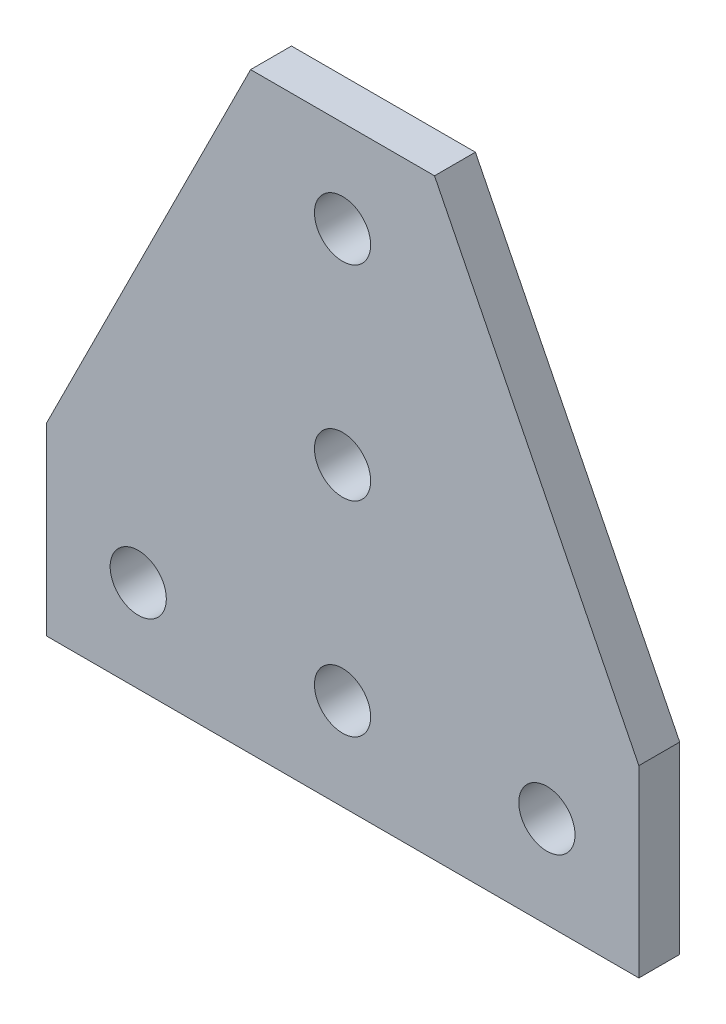
ISO-10303-21;
HEADER;
FILE_DESCRIPTION(('STEP AP214'),'2;1');
FILE_NAME('part.step','',(''),(''),'','','');
FILE_SCHEMA(('AUTOMOTIVE_DESIGN { 1 0 10303 214 1 1 1 1 }'));
ENDSEC;
DATA;
#1=APPLICATION_CONTEXT('core data for automotive mechanical design processes');
#2=APPLICATION_PROTOCOL_DEFINITION('international standard','automotive_design',2000,#1);
#3=PRODUCT_CONTEXT('',#1,'mechanical');
#4=PRODUCT('Part','Part','',(#3));
#5=PRODUCT_RELATED_PRODUCT_CATEGORY('part','',(#4));
#6=PRODUCT_DEFINITION_FORMATION('','',#4);
#7=PRODUCT_DEFINITION_CONTEXT('part definition',#1,'design');
#8=PRODUCT_DEFINITION('design','',#6,#7);
#9=PRODUCT_DEFINITION_SHAPE('','',#8);
#10=(LENGTH_UNIT() NAMED_UNIT(*) SI_UNIT(.MILLI.,.METRE.));
#11=(NAMED_UNIT(*) PLANE_ANGLE_UNIT() SI_UNIT($,.RADIAN.));
#12=(NAMED_UNIT(*) SI_UNIT($,.STERADIAN.) SOLID_ANGLE_UNIT());
#13=UNCERTAINTY_MEASURE_WITH_UNIT(LENGTH_MEASURE(1.E-05),#10,'distance_accuracy_value','');
#14=(GEOMETRIC_REPRESENTATION_CONTEXT(3) GLOBAL_UNCERTAINTY_ASSIGNED_CONTEXT((#13)) GLOBAL_UNIT_ASSIGNED_CONTEXT((#10,
#11,#12)) REPRESENTATION_CONTEXT('',''));
#15=CARTESIAN_POINT('',(0.,0.,0.));
#16=DIRECTION('',(0.,0.,1.));
#17=DIRECTION('',(1.,0.,0.));
#18=AXIS2_PLACEMENT_3D('',#15,#16,#17);
#19=CARTESIAN_POINT('',(0.,0.,2.));
#20=DIRECTION('',(0.,0.,1.));
#21=DIRECTION('',(1.,0.,0.));
#22=AXIS2_PLACEMENT_3D('',#19,#20,#21);
#23=PLANE('',#22);
#24=CARTESIAN_POINT('',(0.,29.,2.));
#25=DIRECTION('',(0.,0.,1.));
#26=DIRECTION('',(1.,0.,0.));
#27=AXIS2_PLACEMENT_3D('',#24,#25,#26);
#28=CIRCLE('',#27,2.75);
#29=CARTESIAN_POINT('',(2.75,29.,2.));
#30=VERTEX_POINT('',#29);
#31=EDGE_CURVE('E193',#30,#30,#28,.T.);
#32=ORIENTED_EDGE('',*,*,#31,.F.);
#33=EDGE_LOOP('',(#32));
#34=FACE_BOUND('',#33,.T.);
#35=CARTESIAN_POINT('',(-20.,9.,2.));
#36=DIRECTION('',(0.,0.,1.));
#37=DIRECTION('',(1.,0.,0.));
#38=AXIS2_PLACEMENT_3D('',#35,#36,#37);
#39=CIRCLE('',#38,2.75);
#40=CARTESIAN_POINT('',(-17.25,9.,2.));
#41=VERTEX_POINT('',#40);
#42=EDGE_CURVE('E205',#41,#41,#39,.T.);
#43=ORIENTED_EDGE('',*,*,#42,.F.);
#44=EDGE_LOOP('',(#43));
#45=FACE_BOUND('',#44,.T.);
#46=DIRECTION('',(0.,-1.,0.));
#47=VECTOR('',#46,1.);
#48=CARTESIAN_POINT('',(-29.,18.,2.));
#49=LINE('',#48,#47);
#50=CARTESIAN_POINT('',(-29.,18.,2.));
#51=VERTEX_POINT('',#50);
#52=CARTESIAN_POINT('',(-29.,0.,2.));
#53=VERTEX_POINT('',#52);
#54=EDGE_CURVE('E128',#51,#53,#49,.T.);
#55=ORIENTED_EDGE('',*,*,#54,.T.);
#56=DIRECTION('',(1.,0.,0.));
#57=VECTOR('',#56,1.);
#58=CARTESIAN_POINT('',(-29.,0.,2.));
#59=LINE('',#58,#57);
#60=CARTESIAN_POINT('',(29.,0.,2.));
#61=VERTEX_POINT('',#60);
#62=EDGE_CURVE('E86',#53,#61,#59,.T.);
#63=ORIENTED_EDGE('',*,*,#62,.T.);
#64=DIRECTION('',(0.,1.,0.));
#65=VECTOR('',#64,1.);
#66=CARTESIAN_POINT('',(29.,0.,2.));
#67=LINE('',#66,#65);
#68=CARTESIAN_POINT('',(29.,18.,2.));
#69=VERTEX_POINT('',#68);
#70=EDGE_CURVE('E99',#61,#69,#67,.T.);
#71=ORIENTED_EDGE('',*,*,#70,.T.);
#72=DIRECTION('',(-0.447213595499958,0.894427190999916,0.));
#73=VECTOR('',#72,1.);
#74=CARTESIAN_POINT('',(29.,18.,2.));
#75=LINE('',#74,#73);
#76=CARTESIAN_POINT('',(9.,58.,2.));
#77=VERTEX_POINT('',#76);
#78=EDGE_CURVE('E93',#69,#77,#75,.T.);
#79=ORIENTED_EDGE('',*,*,#78,.T.);
#80=DIRECTION('',(-1.,0.,0.));
#81=VECTOR('',#80,1.);
#82=CARTESIAN_POINT('',(9.,58.,2.));
#83=LINE('',#82,#81);
#84=CARTESIAN_POINT('',(-9.,58.,2.));
#85=VERTEX_POINT('',#84);
#86=EDGE_CURVE('E97',#77,#85,#83,.T.);
#87=ORIENTED_EDGE('',*,*,#86,.T.);
#88=DIRECTION('',(-0.447213595499958,-0.894427190999916,0.));
#89=VECTOR('',#88,1.);
#90=CARTESIAN_POINT('',(-9.,58.,2.));
#91=LINE('',#90,#89);
#92=EDGE_CURVE('E49',#85,#51,#91,.T.);
#93=ORIENTED_EDGE('',*,*,#92,.T.);
#94=EDGE_LOOP('',(#55,#63,#71,#79,#87,#93));
#95=FACE_BOUND('',#94,.T.);
#96=CARTESIAN_POINT('',(0.,9.,2.));
#97=DIRECTION('',(0.,0.,1.));
#98=DIRECTION('',(1.,0.,0.));
#99=AXIS2_PLACEMENT_3D('',#96,#97,#98);
#100=CIRCLE('',#99,2.75);
#101=CARTESIAN_POINT('',(2.75,9.,2.));
#102=VERTEX_POINT('',#101);
#103=EDGE_CURVE('E121',#102,#102,#100,.T.);
#104=ORIENTED_EDGE('',*,*,#103,.F.);
#105=EDGE_LOOP('',(#104));
#106=FACE_BOUND('',#105,.T.);
#107=CARTESIAN_POINT('',(20.,9.,2.));
#108=DIRECTION('',(0.,0.,1.));
#109=DIRECTION('',(1.,0.,0.));
#110=AXIS2_PLACEMENT_3D('',#107,#108,#109);
#111=CIRCLE('',#110,2.75);
#112=CARTESIAN_POINT('',(22.75,9.,2.));
#113=VERTEX_POINT('',#112);
#114=EDGE_CURVE('E199',#113,#113,#111,.T.);
#115=ORIENTED_EDGE('',*,*,#114,.F.);
#116=EDGE_LOOP('',(#115));
#117=FACE_BOUND('',#116,.T.);
#118=CARTESIAN_POINT('',(0.,49.,2.));
#119=DIRECTION('',(0.,0.,1.));
#120=DIRECTION('',(1.,0.,0.));
#121=AXIS2_PLACEMENT_3D('',#118,#119,#120);
#122=CIRCLE('',#121,2.75);
#123=CARTESIAN_POINT('',(2.75,49.,2.));
#124=VERTEX_POINT('',#123);
#125=EDGE_CURVE('E184',#124,#124,#122,.T.);
#126=ORIENTED_EDGE('',*,*,#125,.F.);
#127=EDGE_LOOP('',(#126));
#128=FACE_BOUND('',#127,.T.);
#129=ADVANCED_FACE('F32',(#34,#45,#95,#106,#117,#128),#23,.T.);
#130=CARTESIAN_POINT('',(0.,0.,-2.));
#131=DIRECTION('',(0.,0.,1.));
#132=DIRECTION('',(1.,0.,0.));
#133=AXIS2_PLACEMENT_3D('',#130,#131,#132);
#134=PLANE('',#133);
#135=CARTESIAN_POINT('',(0.,29.,-2.));
#136=DIRECTION('',(0.,0.,1.));
#137=DIRECTION('',(1.,0.,0.));
#138=AXIS2_PLACEMENT_3D('',#135,#136,#137);
#139=CIRCLE('',#138,2.75);
#140=CARTESIAN_POINT('',(2.75,29.,-2.));
#141=VERTEX_POINT('',#140);
#142=EDGE_CURVE('E190',#141,#141,#139,.T.);
#143=ORIENTED_EDGE('',*,*,#142,.T.);
#144=EDGE_LOOP('',(#143));
#145=FACE_BOUND('',#144,.T.);
#146=CARTESIAN_POINT('',(-20.,9.,-2.));
#147=DIRECTION('',(0.,0.,1.));
#148=DIRECTION('',(1.,0.,0.));
#149=AXIS2_PLACEMENT_3D('',#146,#147,#148);
#150=CIRCLE('',#149,2.75);
#151=CARTESIAN_POINT('',(-17.25,9.,-2.));
#152=VERTEX_POINT('',#151);
#153=EDGE_CURVE('E202',#152,#152,#150,.T.);
#154=ORIENTED_EDGE('',*,*,#153,.T.);
#155=EDGE_LOOP('',(#154));
#156=FACE_BOUND('',#155,.T.);
#157=DIRECTION('',(0.,-1.,0.));
#158=VECTOR('',#157,1.);
#159=CARTESIAN_POINT('',(-29.,18.,-2.));
#160=LINE('',#159,#158);
#161=CARTESIAN_POINT('',(-29.,18.,-2.));
#162=VERTEX_POINT('',#161);
#163=CARTESIAN_POINT('',(-29.,0.,-2.));
#164=VERTEX_POINT('',#163);
#165=EDGE_CURVE('E117',#162,#164,#160,.T.);
#166=ORIENTED_EDGE('',*,*,#165,.F.);
#167=DIRECTION('',(-0.447213595499958,-0.894427190999916,0.));
#168=VECTOR('',#167,1.);
#169=CARTESIAN_POINT('',(-9.,58.,-2.));
#170=LINE('',#169,#168);
#171=CARTESIAN_POINT('',(-9.,58.,-2.));
#172=VERTEX_POINT('',#171);
#173=EDGE_CURVE('E78',#172,#162,#170,.T.);
#174=ORIENTED_EDGE('',*,*,#173,.F.);
#175=DIRECTION('',(-1.,0.,0.));
#176=VECTOR('',#175,1.);
#177=CARTESIAN_POINT('',(9.,58.,-2.));
#178=LINE('',#177,#176);
#179=CARTESIAN_POINT('',(9.,58.,-2.));
#180=VERTEX_POINT('',#179);
#181=EDGE_CURVE('E72',#180,#172,#178,.T.);
#182=ORIENTED_EDGE('',*,*,#181,.F.);
#183=DIRECTION('',(-0.447213595499958,0.894427190999916,0.));
#184=VECTOR('',#183,1.);
#185=CARTESIAN_POINT('',(29.,18.,-2.));
#186=LINE('',#185,#184);
#187=CARTESIAN_POINT('',(29.,18.,-2.));
#188=VERTEX_POINT('',#187);
#189=EDGE_CURVE('E107',#188,#180,#186,.T.);
#190=ORIENTED_EDGE('',*,*,#189,.F.);
#191=DIRECTION('',(0.,1.,0.));
#192=VECTOR('',#191,1.);
#193=CARTESIAN_POINT('',(29.,0.,-2.));
#194=LINE('',#193,#192);
#195=CARTESIAN_POINT('',(29.,0.,-2.));
#196=VERTEX_POINT('',#195);
#197=EDGE_CURVE('E123',#196,#188,#194,.T.);
#198=ORIENTED_EDGE('',*,*,#197,.F.);
#199=DIRECTION('',(1.,0.,0.));
#200=VECTOR('',#199,1.);
#201=CARTESIAN_POINT('',(-29.,0.,-2.));
#202=LINE('',#201,#200);
#203=EDGE_CURVE('E120',#164,#196,#202,.T.);
#204=ORIENTED_EDGE('',*,*,#203,.F.);
#205=EDGE_LOOP('',(#166,#174,#182,#190,#198,#204));
#206=FACE_BOUND('',#205,.T.);
#207=CARTESIAN_POINT('',(0.,9.,-2.));
#208=DIRECTION('',(0.,0.,1.));
#209=DIRECTION('',(1.,0.,0.));
#210=AXIS2_PLACEMENT_3D('',#207,#208,#209);
#211=CIRCLE('',#210,2.75);
#212=CARTESIAN_POINT('',(2.75,9.,-2.));
#213=VERTEX_POINT('',#212);
#214=EDGE_CURVE('E208',#213,#213,#211,.T.);
#215=ORIENTED_EDGE('',*,*,#214,.T.);
#216=EDGE_LOOP('',(#215));
#217=FACE_BOUND('',#216,.T.);
#218=CARTESIAN_POINT('',(20.,9.,-2.));
#219=DIRECTION('',(0.,0.,1.));
#220=DIRECTION('',(1.,0.,0.));
#221=AXIS2_PLACEMENT_3D('',#218,#219,#220);
#222=CIRCLE('',#221,2.75);
#223=CARTESIAN_POINT('',(22.75,9.,-2.));
#224=VERTEX_POINT('',#223);
#225=EDGE_CURVE('E196',#224,#224,#222,.T.);
#226=ORIENTED_EDGE('',*,*,#225,.T.);
#227=EDGE_LOOP('',(#226));
#228=FACE_BOUND('',#227,.T.);
#229=CARTESIAN_POINT('',(0.,49.,-2.));
#230=DIRECTION('',(0.,0.,1.));
#231=DIRECTION('',(1.,0.,0.));
#232=AXIS2_PLACEMENT_3D('',#229,#230,#231);
#233=CIRCLE('',#232,2.75);
#234=CARTESIAN_POINT('',(2.75,49.,-2.));
#235=VERTEX_POINT('',#234);
#236=EDGE_CURVE('E187',#235,#235,#233,.T.);
#237=ORIENTED_EDGE('',*,*,#236,.T.);
#238=EDGE_LOOP('',(#237));
#239=FACE_BOUND('',#238,.T.);
#240=ADVANCED_FACE('F137',(#145,#156,#206,#217,#228,#239),#134,.F.);
#241=CARTESIAN_POINT('',(-29.,18.,2.));
#242=DIRECTION('',(1.,0.,0.));
#243=DIRECTION('',(0.,1.,0.));
#244=AXIS2_PLACEMENT_3D('',#241,#242,#243);
#245=PLANE('',#244);
#246=ORIENTED_EDGE('',*,*,#165,.T.);
#247=DIRECTION('',(0.,0.,-1.));
#248=VECTOR('',#247,1.);
#249=CARTESIAN_POINT('',(-29.,0.,2.));
#250=LINE('',#249,#248);
#251=EDGE_CURVE('E11',#53,#164,#250,.T.);
#252=ORIENTED_EDGE('',*,*,#251,.F.);
#253=ORIENTED_EDGE('',*,*,#54,.F.);
#254=DIRECTION('',(0.,0.,-1.));
#255=VECTOR('',#254,1.);
#256=CARTESIAN_POINT('',(-29.,18.,2.));
#257=LINE('',#256,#255);
#258=EDGE_CURVE('E113',#51,#162,#257,.T.);
#259=ORIENTED_EDGE('',*,*,#258,.T.);
#260=EDGE_LOOP('',(#246,#252,#253,#259));
#261=FACE_BOUND('',#260,.T.);
#262=ADVANCED_FACE('F34',(#261),#245,.F.);
#263=CARTESIAN_POINT('',(-29.,0.,2.));
#264=DIRECTION('',(0.,1.,0.));
#265=DIRECTION('',(-1.,0.,0.));
#266=AXIS2_PLACEMENT_3D('',#263,#264,#265);
#267=PLANE('',#266);
#268=ORIENTED_EDGE('',*,*,#203,.T.);
#269=DIRECTION('',(0.,0.,-1.));
#270=VECTOR('',#269,1.);
#271=CARTESIAN_POINT('',(29.,0.,2.));
#272=LINE('',#271,#270);
#273=EDGE_CURVE('E41',#61,#196,#272,.T.);
#274=ORIENTED_EDGE('',*,*,#273,.F.);
#275=ORIENTED_EDGE('',*,*,#62,.F.);
#276=ORIENTED_EDGE('',*,*,#251,.T.);
#277=EDGE_LOOP('',(#268,#274,#275,#276));
#278=FACE_BOUND('',#277,.T.);
#279=ADVANCED_FACE('F274',(#278),#267,.F.);
#280=CARTESIAN_POINT('',(29.,0.,2.));
#281=DIRECTION('',(-1.,0.,0.));
#282=DIRECTION('',(0.,-1.,0.));
#283=AXIS2_PLACEMENT_3D('',#280,#281,#282);
#284=PLANE('',#283);
#285=ORIENTED_EDGE('',*,*,#197,.T.);
#286=DIRECTION('',(0.,0.,-1.));
#287=VECTOR('',#286,1.);
#288=CARTESIAN_POINT('',(29.,18.,2.));
#289=LINE('',#288,#287);
#290=EDGE_CURVE('E108',#69,#188,#289,.T.);
#291=ORIENTED_EDGE('',*,*,#290,.F.);
#292=ORIENTED_EDGE('',*,*,#70,.F.);
#293=ORIENTED_EDGE('',*,*,#273,.T.);
#294=EDGE_LOOP('',(#285,#291,#292,#293));
#295=FACE_BOUND('',#294,.T.);
#296=ADVANCED_FACE('F134',(#295),#284,.F.);
#297=CARTESIAN_POINT('',(29.,18.,2.));
#298=DIRECTION('',(-0.894427190999916,-0.447213595499958,0.));
#299=DIRECTION('',(0.447213595499958,-0.894427190999916,0.));
#300=AXIS2_PLACEMENT_3D('',#297,#298,#299);
#301=PLANE('',#300);
#302=ORIENTED_EDGE('',*,*,#189,.T.);
#303=DIRECTION('',(0.,0.,-1.));
#304=VECTOR('',#303,1.);
#305=CARTESIAN_POINT('',(9.,58.,2.));
#306=LINE('',#305,#304);
#307=EDGE_CURVE('E104',#77,#180,#306,.T.);
#308=ORIENTED_EDGE('',*,*,#307,.F.);
#309=ORIENTED_EDGE('',*,*,#78,.F.);
#310=ORIENTED_EDGE('',*,*,#290,.T.);
#311=EDGE_LOOP('',(#302,#308,#309,#310));
#312=FACE_BOUND('',#311,.T.);
#313=ADVANCED_FACE('F105',(#312),#301,.F.);
#314=CARTESIAN_POINT('',(9.,58.,2.));
#315=DIRECTION('',(0.,-1.,0.));
#316=DIRECTION('',(0.,0.,-1.));
#317=AXIS2_PLACEMENT_3D('',#314,#315,#316);
#318=PLANE('',#317);
#319=ORIENTED_EDGE('',*,*,#181,.T.);
#320=DIRECTION('',(0.,0.,-1.));
#321=VECTOR('',#320,1.);
#322=CARTESIAN_POINT('',(-9.,58.,2.));
#323=LINE('',#322,#321);
#324=EDGE_CURVE('E109',#85,#172,#323,.T.);
#325=ORIENTED_EDGE('',*,*,#324,.F.);
#326=ORIENTED_EDGE('',*,*,#86,.F.);
#327=ORIENTED_EDGE('',*,*,#307,.T.);
#328=EDGE_LOOP('',(#319,#325,#326,#327));
#329=FACE_BOUND('',#328,.T.);
#330=ADVANCED_FACE('F111',(#329),#318,.F.);
#331=CARTESIAN_POINT('',(-9.,58.,2.));
#332=DIRECTION('',(0.894427190999916,-0.447213595499958,0.));
#333=DIRECTION('',(0.447213595499958,0.894427190999916,0.));
#334=AXIS2_PLACEMENT_3D('',#331,#332,#333);
#335=PLANE('',#334);
#336=ORIENTED_EDGE('',*,*,#173,.T.);
#337=ORIENTED_EDGE('',*,*,#258,.F.);
#338=ORIENTED_EDGE('',*,*,#92,.F.);
#339=ORIENTED_EDGE('',*,*,#324,.T.);
#340=EDGE_LOOP('',(#336,#337,#338,#339));
#341=FACE_BOUND('',#340,.T.);
#342=ADVANCED_FACE('F142',(#341),#335,.F.);
#343=CARTESIAN_POINT('',(0.,9.,2.));
#344=DIRECTION('',(0.,0.,-1.));
#345=DIRECTION('',(-1.,0.,0.));
#346=AXIS2_PLACEMENT_3D('',#343,#344,#345);
#347=CYLINDRICAL_SURFACE('',#346,2.75);
#348=ORIENTED_EDGE('',*,*,#103,.T.);
#349=EDGE_LOOP('',(#348));
#350=FACE_BOUND('',#349,.T.);
#351=ORIENTED_EDGE('',*,*,#214,.F.);
#352=EDGE_LOOP('',(#351));
#353=FACE_BOUND('',#352,.T.);
#354=ADVANCED_FACE('F144',(#350,#353),#347,.F.);
#355=CARTESIAN_POINT('',(-20.,9.,2.));
#356=DIRECTION('',(0.,0.,-1.));
#357=DIRECTION('',(-1.,0.,0.));
#358=AXIS2_PLACEMENT_3D('',#355,#356,#357);
#359=CYLINDRICAL_SURFACE('',#358,2.75);
#360=ORIENTED_EDGE('',*,*,#42,.T.);
#361=EDGE_LOOP('',(#360));
#362=FACE_BOUND('',#361,.T.);
#363=ORIENTED_EDGE('',*,*,#153,.F.);
#364=EDGE_LOOP('',(#363));
#365=FACE_BOUND('',#364,.T.);
#366=ADVANCED_FACE('F150',(#362,#365),#359,.F.);
#367=CARTESIAN_POINT('',(20.,9.,2.));
#368=DIRECTION('',(0.,0.,-1.));
#369=DIRECTION('',(-1.,0.,0.));
#370=AXIS2_PLACEMENT_3D('',#367,#368,#369);
#371=CYLINDRICAL_SURFACE('',#370,2.75);
#372=ORIENTED_EDGE('',*,*,#114,.T.);
#373=EDGE_LOOP('',(#372));
#374=FACE_BOUND('',#373,.T.);
#375=ORIENTED_EDGE('',*,*,#225,.F.);
#376=EDGE_LOOP('',(#375));
#377=FACE_BOUND('',#376,.T.);
#378=ADVANCED_FACE('F167',(#374,#377),#371,.F.);
#379=CARTESIAN_POINT('',(0.,29.,2.));
#380=DIRECTION('',(0.,0.,-1.));
#381=DIRECTION('',(-1.,0.,0.));
#382=AXIS2_PLACEMENT_3D('',#379,#380,#381);
#383=CYLINDRICAL_SURFACE('',#382,2.75);
#384=ORIENTED_EDGE('',*,*,#31,.T.);
#385=EDGE_LOOP('',(#384));
#386=FACE_BOUND('',#385,.T.);
#387=ORIENTED_EDGE('',*,*,#142,.F.);
#388=EDGE_LOOP('',(#387));
#389=FACE_BOUND('',#388,.T.);
#390=ADVANCED_FACE('F171',(#386,#389),#383,.F.);
#391=CARTESIAN_POINT('',(0.,49.,2.));
#392=DIRECTION('',(0.,0.,-1.));
#393=DIRECTION('',(-1.,0.,0.));
#394=AXIS2_PLACEMENT_3D('',#391,#392,#393);
#395=CYLINDRICAL_SURFACE('',#394,2.75);
#396=ORIENTED_EDGE('',*,*,#125,.T.);
#397=EDGE_LOOP('',(#396));
#398=FACE_BOUND('',#397,.T.);
#399=ORIENTED_EDGE('',*,*,#236,.F.);
#400=EDGE_LOOP('',(#399));
#401=FACE_BOUND('',#400,.T.);
#402=ADVANCED_FACE('F175',(#398,#401),#395,.F.);
#403=CLOSED_SHELL('',(#129,#240,#262,#279,#296,#313,#330,#342,#354,#366,#378,#390,#402));
#404=MANIFOLD_SOLID_BREP('B2',#403);
#405=ADVANCED_BREP_SHAPE_REPRESENTATION('',(#18,#404),#14);
#406=SHAPE_DEFINITION_REPRESENTATION(#9,#405);
ENDSEC;
END-ISO-10303-21;
